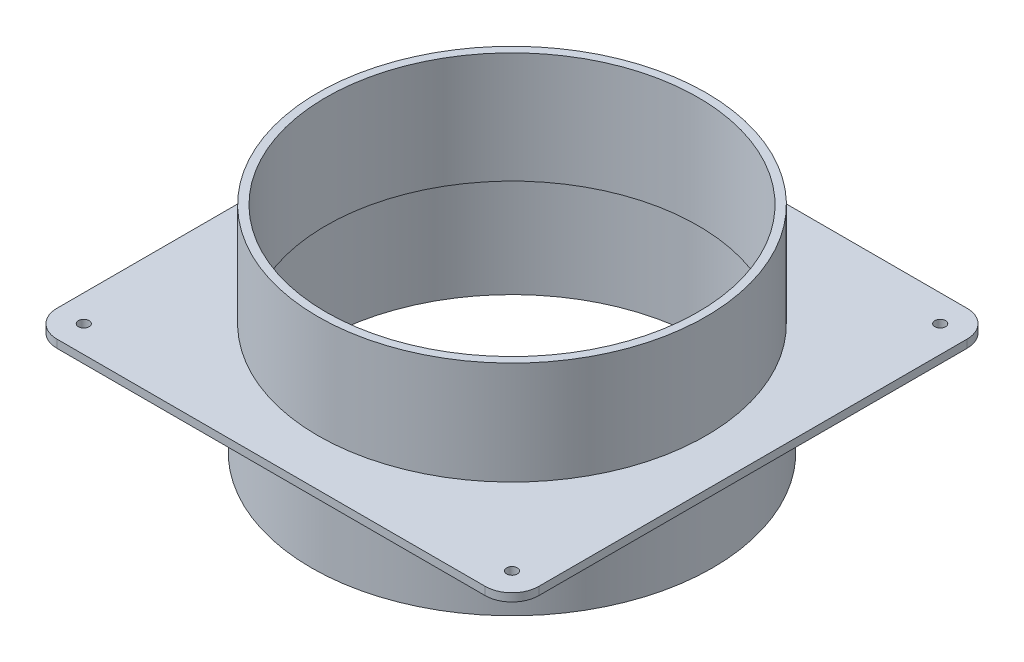
ISO-10303-21;
HEADER;
FILE_DESCRIPTION(('STEP AP214'),'2;1');
FILE_NAME('part.step','',(''),(''),'','','');
FILE_SCHEMA(('AUTOMOTIVE_DESIGN { 1 0 10303 214 1 1 1 1 }'));
ENDSEC;
DATA;
#1=APPLICATION_CONTEXT('core data for automotive mechanical design processes');
#2=APPLICATION_PROTOCOL_DEFINITION('international standard','automotive_design',2000,#1);
#3=PRODUCT_CONTEXT('',#1,'mechanical');
#4=PRODUCT('Part','Part','',(#3));
#5=PRODUCT_RELATED_PRODUCT_CATEGORY('part','',(#4));
#6=PRODUCT_DEFINITION_FORMATION('','',#4);
#7=PRODUCT_DEFINITION_CONTEXT('part definition',#1,'design');
#8=PRODUCT_DEFINITION('design','',#6,#7);
#9=PRODUCT_DEFINITION_SHAPE('','',#8);
#10=(LENGTH_UNIT() NAMED_UNIT(*) SI_UNIT(.MILLI.,.METRE.));
#11=(NAMED_UNIT(*) PLANE_ANGLE_UNIT() SI_UNIT($,.RADIAN.));
#12=(NAMED_UNIT(*) SI_UNIT($,.STERADIAN.) SOLID_ANGLE_UNIT());
#13=UNCERTAINTY_MEASURE_WITH_UNIT(LENGTH_MEASURE(1.E-05),#10,'distance_accuracy_value','');
#14=(GEOMETRIC_REPRESENTATION_CONTEXT(3) GLOBAL_UNCERTAINTY_ASSIGNED_CONTEXT((#13)) GLOBAL_UNIT_ASSIGNED_CONTEXT((#10,
#11,#12)) REPRESENTATION_CONTEXT('',''));
#15=CARTESIAN_POINT('',(0.,0.,0.));
#16=DIRECTION('',(0.,0.,1.));
#17=DIRECTION('',(1.,0.,0.));
#18=AXIS2_PLACEMENT_3D('',#15,#16,#17);
#19=CARTESIAN_POINT('',(0.,-1.50000000000006,0.));
#20=DIRECTION('',(0.,1.,0.));
#21=DIRECTION('',(0.,0.,1.));
#22=AXIS2_PLACEMENT_3D('',#19,#20,#21);
#23=PLANE('',#22);
#24=CARTESIAN_POINT('',(0.,-1.50000000000006,0.));
#25=DIRECTION('',(0.,1.,0.));
#26=DIRECTION('',(0.,0.,1.));
#27=AXIS2_PLACEMENT_3D('',#24,#25,#26);
#28=CIRCLE('',#27,69.5);
#29=CARTESIAN_POINT('',(0.,-1.50000000000006,69.5));
#30=VERTEX_POINT('',#29);
#31=EDGE_CURVE('E146',#30,#30,#28,.T.);
#32=ORIENTED_EDGE('',*,*,#31,.T.);
#33=EDGE_LOOP('',(#32));
#34=FACE_BOUND('',#33,.T.);
#35=CARTESIAN_POINT('',(0.,-1.50000000000006,0.));
#36=DIRECTION('',(0.,1.,0.));
#37=DIRECTION('',(0.,0.,1.));
#38=AXIS2_PLACEMENT_3D('',#35,#36,#37);
#39=CIRCLE('',#38,72.);
#40=CARTESIAN_POINT('',(0.,-1.50000000000006,72.));
#41=VERTEX_POINT('',#40);
#42=EDGE_CURVE('E11',#41,#41,#39,.T.);
#43=ORIENTED_EDGE('',*,*,#42,.F.);
#44=EDGE_LOOP('',(#43));
#45=FACE_BOUND('',#44,.T.);
#46=ADVANCED_FACE('F36',(#34,#45),#23,.F.);
#47=CARTESIAN_POINT('',(0.,1.50000000000006,0.));
#48=DIRECTION('',(0.,1.,0.));
#49=DIRECTION('',(0.,0.,1.));
#50=AXIS2_PLACEMENT_3D('',#47,#48,#49);
#51=PLANE('',#50);
#52=CARTESIAN_POINT('',(80.,1.50000000000006,-80.));
#53=DIRECTION('',(0.,1.,0.));
#54=DIRECTION('',(0.,0.,1.));
#55=AXIS2_PLACEMENT_3D('',#52,#53,#54);
#56=CIRCLE('',#55,9.99999999999999);
#57=CARTESIAN_POINT('',(79.9999999999999,1.50000000000006,-90.));
#58=VERTEX_POINT('',#57);
#59=CARTESIAN_POINT('',(90.,1.50000000000006,-79.9999999999999));
#60=VERTEX_POINT('',#59);
#61=EDGE_CURVE('E104',#58,#60,#56,.F.);
#62=ORIENTED_EDGE('',*,*,#61,.F.);
#63=DIRECTION('',(-1.,0.,0.));
#64=VECTOR('',#63,1.);
#65=CARTESIAN_POINT('',(0.,1.50000000000006,-90.));
#66=LINE('',#65,#64);
#67=CARTESIAN_POINT('',(-80.,1.50000000000006,-90.));
#68=VERTEX_POINT('',#67);
#69=EDGE_CURVE('E113',#58,#68,#66,.T.);
#70=ORIENTED_EDGE('',*,*,#69,.T.);
#71=CARTESIAN_POINT('',(-80.,1.50000000000006,-80.));
#72=DIRECTION('',(0.,1.,0.));
#73=DIRECTION('',(0.,0.,1.));
#74=AXIS2_PLACEMENT_3D('',#71,#72,#73);
#75=CIRCLE('',#74,9.99999999999999);
#76=CARTESIAN_POINT('',(-90.,1.50000000000006,-79.9999999999999));
#77=VERTEX_POINT('',#76);
#78=EDGE_CURVE('E118',#68,#77,#75,.T.);
#79=ORIENTED_EDGE('',*,*,#78,.T.);
#80=DIRECTION('',(0.,0.,1.));
#81=VECTOR('',#80,1.);
#82=CARTESIAN_POINT('',(-90.,1.50000000000006,0.));
#83=LINE('',#82,#81);
#84=CARTESIAN_POINT('',(-90.,1.50000000000006,79.9999999999999));
#85=VERTEX_POINT('',#84);
#86=EDGE_CURVE('E133',#77,#85,#83,.T.);
#87=ORIENTED_EDGE('',*,*,#86,.T.);
#88=CARTESIAN_POINT('',(-80.,1.50000000000006,80.));
#89=DIRECTION('',(0.,1.,0.));
#90=DIRECTION('',(0.,0.,1.));
#91=AXIS2_PLACEMENT_3D('',#88,#89,#90);
#92=CIRCLE('',#91,9.99999999999999);
#93=CARTESIAN_POINT('',(-79.9999999999999,1.50000000000006,90.));
#94=VERTEX_POINT('',#93);
#95=EDGE_CURVE('E136',#94,#85,#92,.F.);
#96=ORIENTED_EDGE('',*,*,#95,.F.);
#97=DIRECTION('',(-1.,0.,0.));
#98=VECTOR('',#97,1.);
#99=CARTESIAN_POINT('',(0.,1.50000000000006,90.));
#100=LINE('',#99,#98);
#101=CARTESIAN_POINT('',(79.9999999999999,1.50000000000006,90.));
#102=VERTEX_POINT('',#101);
#103=EDGE_CURVE('E139',#102,#94,#100,.T.);
#104=ORIENTED_EDGE('',*,*,#103,.F.);
#105=CARTESIAN_POINT('',(80.,1.50000000000006,80.));
#106=DIRECTION('',(0.,1.,0.));
#107=DIRECTION('',(0.,0.,1.));
#108=AXIS2_PLACEMENT_3D('',#105,#106,#107);
#109=CIRCLE('',#108,9.99999999999999);
#110=CARTESIAN_POINT('',(90.,1.50000000000006,79.9999999999999));
#111=VERTEX_POINT('',#110);
#112=EDGE_CURVE('E142',#111,#102,#109,.F.);
#113=ORIENTED_EDGE('',*,*,#112,.F.);
#114=DIRECTION('',(0.,0.,1.));
#115=VECTOR('',#114,1.);
#116=CARTESIAN_POINT('',(90.,1.50000000000006,0.));
#117=LINE('',#116,#115);
#118=EDGE_CURVE('E124',#60,#111,#117,.T.);
#119=ORIENTED_EDGE('',*,*,#118,.F.);
#120=EDGE_LOOP('',(#62,#70,#79,#87,#96,#104,#113,#119));
#121=FACE_BOUND('',#120,.T.);
#122=CARTESIAN_POINT('',(-80.,1.50000000000006,80.));
#123=DIRECTION('',(0.,1.,0.));
#124=DIRECTION('',(0.,0.,1.));
#125=AXIS2_PLACEMENT_3D('',#122,#123,#124);
#126=CIRCLE('',#125,2.);
#127=CARTESIAN_POINT('',(-80.,1.50000000000006,82.));
#128=VERTEX_POINT('',#127);
#129=EDGE_CURVE('E125',#128,#128,#126,.T.);
#130=ORIENTED_EDGE('',*,*,#129,.F.);
#131=EDGE_LOOP('',(#130));
#132=FACE_BOUND('',#131,.T.);
#133=CARTESIAN_POINT('',(80.,1.50000000000006,80.));
#134=DIRECTION('',(0.,1.,0.));
#135=DIRECTION('',(0.,0.,1.));
#136=AXIS2_PLACEMENT_3D('',#133,#134,#135);
#137=CIRCLE('',#136,2.);
#138=CARTESIAN_POINT('',(80.,1.50000000000006,82.));
#139=VERTEX_POINT('',#138);
#140=EDGE_CURVE('E128',#139,#139,#137,.T.);
#141=ORIENTED_EDGE('',*,*,#140,.F.);
#142=EDGE_LOOP('',(#141));
#143=FACE_BOUND('',#142,.T.);
#144=CARTESIAN_POINT('',(80.,1.50000000000006,-79.9999999999999));
#145=DIRECTION('',(0.,1.,0.));
#146=DIRECTION('',(0.,0.,1.));
#147=AXIS2_PLACEMENT_3D('',#144,#145,#146);
#148=CIRCLE('',#147,2.);
#149=CARTESIAN_POINT('',(80.,1.50000000000006,-77.9999999999999));
#150=VERTEX_POINT('',#149);
#151=EDGE_CURVE('E196',#150,#150,#148,.T.);
#152=ORIENTED_EDGE('',*,*,#151,.F.);
#153=EDGE_LOOP('',(#152));
#154=FACE_BOUND('',#153,.T.);
#155=CARTESIAN_POINT('',(-80.,1.50000000000006,-80.));
#156=DIRECTION('',(0.,1.,0.));
#157=DIRECTION('',(0.,0.,1.));
#158=AXIS2_PLACEMENT_3D('',#155,#156,#157);
#159=CIRCLE('',#158,2.);
#160=CARTESIAN_POINT('',(-80.,1.50000000000006,-78.));
#161=VERTEX_POINT('',#160);
#162=EDGE_CURVE('E191',#161,#161,#159,.T.);
#163=ORIENTED_EDGE('',*,*,#162,.F.);
#164=EDGE_LOOP('',(#163));
#165=FACE_BOUND('',#164,.T.);
#166=CARTESIAN_POINT('',(0.,1.50000000000006,0.));
#167=DIRECTION('',(0.,1.,0.));
#168=DIRECTION('',(0.,0.,1.));
#169=AXIS2_PLACEMENT_3D('',#166,#167,#168);
#170=CIRCLE('',#169,72.5);
#171=CARTESIAN_POINT('',(0.,1.50000000000006,72.5));
#172=VERTEX_POINT('',#171);
#173=EDGE_CURVE('E189',#172,#172,#170,.F.);
#174=ORIENTED_EDGE('',*,*,#173,.T.);
#175=EDGE_LOOP('',(#174));
#176=FACE_BOUND('',#175,.T.);
#177=ADVANCED_FACE('F120',(#121,#132,#143,#154,#165,#176),#51,.T.);
#178=CARTESIAN_POINT('',(80.,-1.50000000000006,-80.));
#179=DIRECTION('',(0.,1.,0.));
#180=DIRECTION('',(0.,0.,1.));
#181=AXIS2_PLACEMENT_3D('',#178,#179,#180);
#182=CYLINDRICAL_SURFACE('',#181,9.99999999999999);
#183=DIRECTION('',(0.,1.,0.));
#184=VECTOR('',#183,1.);
#185=CARTESIAN_POINT('',(79.9999999999999,-1.50000000000006,-90.));
#186=LINE('',#185,#184);
#187=CARTESIAN_POINT('',(79.9999999999999,-1.50000000000006,-90.));
#188=VERTEX_POINT('',#187);
#189=EDGE_CURVE('E99',#188,#58,#186,.T.);
#190=ORIENTED_EDGE('',*,*,#189,.T.);
#191=ORIENTED_EDGE('',*,*,#61,.T.);
#192=DIRECTION('',(0.,1.,0.));
#193=VECTOR('',#192,1.);
#194=CARTESIAN_POINT('',(90.,-1.50000000000006,-79.9999999999999));
#195=LINE('',#194,#193);
#196=CARTESIAN_POINT('',(90.,-1.50000000000006,-79.9999999999999));
#197=VERTEX_POINT('',#196);
#198=EDGE_CURVE('E45',#197,#60,#195,.T.);
#199=ORIENTED_EDGE('',*,*,#198,.F.);
#200=CARTESIAN_POINT('',(80.,-1.50000000000006,-80.));
#201=DIRECTION('',(0.,1.,0.));
#202=DIRECTION('',(0.,0.,1.));
#203=AXIS2_PLACEMENT_3D('',#200,#201,#202);
#204=CIRCLE('',#203,9.99999999999999);
#205=EDGE_CURVE('E106',#188,#197,#204,.F.);
#206=ORIENTED_EDGE('',*,*,#205,.F.);
#207=EDGE_LOOP('',(#190,#191,#199,#206));
#208=FACE_BOUND('',#207,.T.);
#209=ADVANCED_FACE('F101',(#208),#182,.T.);
#210=CARTESIAN_POINT('',(90.,-1.50000000000006,0.));
#211=DIRECTION('',(-1.,0.,0.));
#212=DIRECTION('',(0.,0.,1.));
#213=AXIS2_PLACEMENT_3D('',#210,#211,#212);
#214=PLANE('',#213);
#215=ORIENTED_EDGE('',*,*,#198,.T.);
#216=ORIENTED_EDGE('',*,*,#118,.T.);
#217=DIRECTION('',(0.,1.,0.));
#218=VECTOR('',#217,1.);
#219=CARTESIAN_POINT('',(90.,-1.50000000000006,79.9999999999999));
#220=LINE('',#219,#218);
#221=CARTESIAN_POINT('',(90.,-1.50000000000006,79.9999999999999));
#222=VERTEX_POINT('',#221);
#223=EDGE_CURVE('E178',#222,#111,#220,.T.);
#224=ORIENTED_EDGE('',*,*,#223,.F.);
#225=DIRECTION('',(0.,0.,1.));
#226=VECTOR('',#225,1.);
#227=CARTESIAN_POINT('',(90.,-1.50000000000006,0.));
#228=LINE('',#227,#226);
#229=EDGE_CURVE('E52',#197,#222,#228,.T.);
#230=ORIENTED_EDGE('',*,*,#229,.F.);
#231=EDGE_LOOP('',(#215,#216,#224,#230));
#232=FACE_BOUND('',#231,.T.);
#233=ADVANCED_FACE('F260',(#232),#214,.F.);
#234=CARTESIAN_POINT('',(80.,-1.50000000000006,80.));
#235=DIRECTION('',(0.,1.,0.));
#236=DIRECTION('',(0.,0.,1.));
#237=AXIS2_PLACEMENT_3D('',#234,#235,#236);
#238=CYLINDRICAL_SURFACE('',#237,9.99999999999999);
#239=ORIENTED_EDGE('',*,*,#223,.T.);
#240=ORIENTED_EDGE('',*,*,#112,.T.);
#241=DIRECTION('',(0.,1.,0.));
#242=VECTOR('',#241,1.);
#243=CARTESIAN_POINT('',(79.9999999999999,-1.50000000000006,90.));
#244=LINE('',#243,#242);
#245=CARTESIAN_POINT('',(79.9999999999999,-1.50000000000006,90.));
#246=VERTEX_POINT('',#245);
#247=EDGE_CURVE('E180',#246,#102,#244,.T.);
#248=ORIENTED_EDGE('',*,*,#247,.F.);
#249=CARTESIAN_POINT('',(80.,-1.50000000000006,80.));
#250=DIRECTION('',(0.,1.,0.));
#251=DIRECTION('',(0.,0.,1.));
#252=AXIS2_PLACEMENT_3D('',#249,#250,#251);
#253=CIRCLE('',#252,9.99999999999999);
#254=EDGE_CURVE('E174',#222,#246,#253,.F.);
#255=ORIENTED_EDGE('',*,*,#254,.F.);
#256=EDGE_LOOP('',(#239,#240,#248,#255));
#257=FACE_BOUND('',#256,.T.);
#258=ADVANCED_FACE('F264',(#257),#238,.T.);
#259=CARTESIAN_POINT('',(0.,-1.50000000000006,90.));
#260=DIRECTION('',(0.,0.,-1.));
#261=DIRECTION('',(-1.,0.,0.));
#262=AXIS2_PLACEMENT_3D('',#259,#260,#261);
#263=PLANE('',#262);
#264=ORIENTED_EDGE('',*,*,#247,.T.);
#265=ORIENTED_EDGE('',*,*,#103,.T.);
#266=DIRECTION('',(0.,1.,0.));
#267=VECTOR('',#266,1.);
#268=CARTESIAN_POINT('',(-79.9999999999999,-1.50000000000006,90.));
#269=LINE('',#268,#267);
#270=CARTESIAN_POINT('',(-79.9999999999999,-1.50000000000006,90.));
#271=VERTEX_POINT('',#270);
#272=EDGE_CURVE('E182',#271,#94,#269,.T.);
#273=ORIENTED_EDGE('',*,*,#272,.F.);
#274=DIRECTION('',(-1.,0.,0.));
#275=VECTOR('',#274,1.);
#276=CARTESIAN_POINT('',(0.,-1.50000000000006,90.));
#277=LINE('',#276,#275);
#278=EDGE_CURVE('E172',#246,#271,#277,.T.);
#279=ORIENTED_EDGE('',*,*,#278,.F.);
#280=EDGE_LOOP('',(#264,#265,#273,#279));
#281=FACE_BOUND('',#280,.T.);
#282=ADVANCED_FACE('F271',(#281),#263,.F.);
#283=CARTESIAN_POINT('',(-80.,-1.50000000000006,80.));
#284=DIRECTION('',(0.,1.,0.));
#285=DIRECTION('',(0.,0.,1.));
#286=AXIS2_PLACEMENT_3D('',#283,#284,#285);
#287=CYLINDRICAL_SURFACE('',#286,9.99999999999999);
#288=ORIENTED_EDGE('',*,*,#272,.T.);
#289=ORIENTED_EDGE('',*,*,#95,.T.);
#290=DIRECTION('',(0.,1.,0.));
#291=VECTOR('',#290,1.);
#292=CARTESIAN_POINT('',(-90.,-1.50000000000006,79.9999999999999));
#293=LINE('',#292,#291);
#294=CARTESIAN_POINT('',(-90.,-1.50000000000006,79.9999999999999));
#295=VERTEX_POINT('',#294);
#296=EDGE_CURVE('E184',#295,#85,#293,.T.);
#297=ORIENTED_EDGE('',*,*,#296,.F.);
#298=CARTESIAN_POINT('',(-80.,-1.50000000000006,80.));
#299=DIRECTION('',(0.,1.,0.));
#300=DIRECTION('',(0.,0.,1.));
#301=AXIS2_PLACEMENT_3D('',#298,#299,#300);
#302=CIRCLE('',#301,9.99999999999999);
#303=EDGE_CURVE('E170',#271,#295,#302,.F.);
#304=ORIENTED_EDGE('',*,*,#303,.F.);
#305=EDGE_LOOP('',(#288,#289,#297,#304));
#306=FACE_BOUND('',#305,.T.);
#307=ADVANCED_FACE('F275',(#306),#287,.T.);
#308=CARTESIAN_POINT('',(-90.,-1.50000000000006,0.));
#309=DIRECTION('',(-1.,0.,0.));
#310=DIRECTION('',(0.,0.,1.));
#311=AXIS2_PLACEMENT_3D('',#308,#309,#310);
#312=PLANE('',#311);
#313=ORIENTED_EDGE('',*,*,#296,.T.);
#314=ORIENTED_EDGE('',*,*,#86,.F.);
#315=DIRECTION('',(0.,1.,0.));
#316=VECTOR('',#315,1.);
#317=CARTESIAN_POINT('',(-90.,-1.50000000000006,-79.9999999999999));
#318=LINE('',#317,#316);
#319=CARTESIAN_POINT('',(-90.,-1.50000000000006,-79.9999999999999));
#320=VERTEX_POINT('',#319);
#321=EDGE_CURVE('E186',#320,#77,#318,.T.);
#322=ORIENTED_EDGE('',*,*,#321,.F.);
#323=DIRECTION('',(0.,0.,1.));
#324=VECTOR('',#323,1.);
#325=CARTESIAN_POINT('',(-90.,-1.50000000000006,0.));
#326=LINE('',#325,#324);
#327=EDGE_CURVE('E167',#320,#295,#326,.T.);
#328=ORIENTED_EDGE('',*,*,#327,.T.);
#329=EDGE_LOOP('',(#313,#314,#322,#328));
#330=FACE_BOUND('',#329,.T.);
#331=ADVANCED_FACE('F278',(#330),#312,.T.);
#332=CARTESIAN_POINT('',(-80.,-1.50000000000006,-80.));
#333=DIRECTION('',(0.,1.,0.));
#334=DIRECTION('',(0.,0.,1.));
#335=AXIS2_PLACEMENT_3D('',#332,#333,#334);
#336=CYLINDRICAL_SURFACE('',#335,9.99999999999999);
#337=ORIENTED_EDGE('',*,*,#321,.T.);
#338=ORIENTED_EDGE('',*,*,#78,.F.);
#339=DIRECTION('',(0.,1.,0.));
#340=VECTOR('',#339,1.);
#341=CARTESIAN_POINT('',(-80.,-1.50000000000006,-90.));
#342=LINE('',#341,#340);
#343=CARTESIAN_POINT('',(-80.,-1.50000000000006,-90.));
#344=VERTEX_POINT('',#343);
#345=EDGE_CURVE('E110',#344,#68,#342,.T.);
#346=ORIENTED_EDGE('',*,*,#345,.F.);
#347=CARTESIAN_POINT('',(-80.,-1.50000000000006,-80.));
#348=DIRECTION('',(0.,1.,0.));
#349=DIRECTION('',(0.,0.,1.));
#350=AXIS2_PLACEMENT_3D('',#347,#348,#349);
#351=CIRCLE('',#350,9.99999999999999);
#352=EDGE_CURVE('E164',#344,#320,#351,.T.);
#353=ORIENTED_EDGE('',*,*,#352,.T.);
#354=EDGE_LOOP('',(#337,#338,#346,#353));
#355=FACE_BOUND('',#354,.T.);
#356=ADVANCED_FACE('F280',(#355),#336,.T.);
#357=CARTESIAN_POINT('',(-80.,-1.50000000000006,80.));
#358=DIRECTION('',(0.,1.,0.));
#359=DIRECTION('',(0.,0.,1.));
#360=AXIS2_PLACEMENT_3D('',#357,#358,#359);
#361=CYLINDRICAL_SURFACE('',#360,2.);
#362=CARTESIAN_POINT('',(-80.,-1.50000000000006,80.));
#363=DIRECTION('',(0.,1.,0.));
#364=DIRECTION('',(0.,0.,1.));
#365=AXIS2_PLACEMENT_3D('',#362,#363,#364);
#366=CIRCLE('',#365,2.);
#367=CARTESIAN_POINT('',(-80.,-1.50000000000006,82.));
#368=VERTEX_POINT('',#367);
#369=EDGE_CURVE('E158',#368,#368,#366,.T.);
#370=ORIENTED_EDGE('',*,*,#369,.F.);
#371=EDGE_LOOP('',(#370));
#372=FACE_BOUND('',#371,.T.);
#373=ORIENTED_EDGE('',*,*,#129,.T.);
#374=EDGE_LOOP('',(#373));
#375=FACE_BOUND('',#374,.T.);
#376=ADVANCED_FACE('F282',(#372,#375),#361,.F.);
#377=CARTESIAN_POINT('',(80.,-1.50000000000006,80.));
#378=DIRECTION('',(0.,1.,0.));
#379=DIRECTION('',(0.,0.,1.));
#380=AXIS2_PLACEMENT_3D('',#377,#378,#379);
#381=CYLINDRICAL_SURFACE('',#380,2.);
#382=CARTESIAN_POINT('',(80.,-1.50000000000006,80.));
#383=DIRECTION('',(0.,1.,0.));
#384=DIRECTION('',(0.,0.,1.));
#385=AXIS2_PLACEMENT_3D('',#382,#383,#384);
#386=CIRCLE('',#385,2.);
#387=CARTESIAN_POINT('',(80.,-1.50000000000006,82.));
#388=VERTEX_POINT('',#387);
#389=EDGE_CURVE('E155',#388,#388,#386,.T.);
#390=ORIENTED_EDGE('',*,*,#389,.F.);
#391=EDGE_LOOP('',(#390));
#392=FACE_BOUND('',#391,.T.);
#393=ORIENTED_EDGE('',*,*,#140,.T.);
#394=EDGE_LOOP('',(#393));
#395=FACE_BOUND('',#394,.T.);
#396=ADVANCED_FACE('F211',(#392,#395),#381,.F.);
#397=CARTESIAN_POINT('',(80.,-1.50000000000006,-79.9999999999999));
#398=DIRECTION('',(0.,1.,0.));
#399=DIRECTION('',(0.,0.,1.));
#400=AXIS2_PLACEMENT_3D('',#397,#398,#399);
#401=CYLINDRICAL_SURFACE('',#400,2.);
#402=CARTESIAN_POINT('',(80.,-1.50000000000006,-79.9999999999999));
#403=DIRECTION('',(0.,1.,0.));
#404=DIRECTION('',(0.,0.,1.));
#405=AXIS2_PLACEMENT_3D('',#402,#403,#404);
#406=CIRCLE('',#405,2.);
#407=CARTESIAN_POINT('',(80.,-1.50000000000006,-77.9999999999999));
#408=VERTEX_POINT('',#407);
#409=EDGE_CURVE('E152',#408,#408,#406,.T.);
#410=ORIENTED_EDGE('',*,*,#409,.F.);
#411=EDGE_LOOP('',(#410));
#412=FACE_BOUND('',#411,.T.);
#413=ORIENTED_EDGE('',*,*,#151,.T.);
#414=EDGE_LOOP('',(#413));
#415=FACE_BOUND('',#414,.T.);
#416=ADVANCED_FACE('F222',(#412,#415),#401,.F.);
#417=CARTESIAN_POINT('',(-80.,-1.50000000000006,-80.));
#418=DIRECTION('',(0.,1.,0.));
#419=DIRECTION('',(0.,0.,1.));
#420=AXIS2_PLACEMENT_3D('',#417,#418,#419);
#421=CYLINDRICAL_SURFACE('',#420,2.);
#422=CARTESIAN_POINT('',(-80.,-1.50000000000006,-80.));
#423=DIRECTION('',(0.,1.,0.));
#424=DIRECTION('',(0.,0.,1.));
#425=AXIS2_PLACEMENT_3D('',#422,#423,#424);
#426=CIRCLE('',#425,2.);
#427=CARTESIAN_POINT('',(-80.,-1.50000000000006,-78.));
#428=VERTEX_POINT('',#427);
#429=EDGE_CURVE('E149',#428,#428,#426,.T.);
#430=ORIENTED_EDGE('',*,*,#429,.F.);
#431=EDGE_LOOP('',(#430));
#432=FACE_BOUND('',#431,.T.);
#433=ORIENTED_EDGE('',*,*,#162,.T.);
#434=EDGE_LOOP('',(#433));
#435=FACE_BOUND('',#434,.T.);
#436=ADVANCED_FACE('F220',(#432,#435),#421,.F.);
#437=CARTESIAN_POINT('',(0.,-1.50000000000006,0.));
#438=DIRECTION('',(0.,1.,0.));
#439=DIRECTION('',(0.,0.,1.));
#440=AXIS2_PLACEMENT_3D('',#437,#438,#439);
#441=CYLINDRICAL_SURFACE('',#440,69.5);
#442=CARTESIAN_POINT('',(0.,40.,0.));
#443=DIRECTION('',(0.,1.,0.));
#444=DIRECTION('',(0.,0.,1.));
#445=AXIS2_PLACEMENT_3D('',#442,#443,#444);
#446=CIRCLE('',#445,69.5);
#447=CARTESIAN_POINT('',(0.,40.,69.5));
#448=VERTEX_POINT('',#447);
#449=EDGE_CURVE('E199',#448,#448,#446,.T.);
#450=ORIENTED_EDGE('',*,*,#449,.T.);
#451=EDGE_LOOP('',(#450));
#452=FACE_BOUND('',#451,.T.);
#453=ORIENTED_EDGE('',*,*,#31,.F.);
#454=EDGE_LOOP('',(#453));
#455=FACE_BOUND('',#454,.T.);
#456=ADVANCED_FACE('F38',(#452,#455),#441,.F.);
#457=CARTESIAN_POINT('',(0.,-1.50000000000006,-90.));
#458=DIRECTION('',(0.,0.,-1.));
#459=DIRECTION('',(-1.,0.,0.));
#460=AXIS2_PLACEMENT_3D('',#457,#458,#459);
#461=PLANE('',#460);
#462=ORIENTED_EDGE('',*,*,#345,.T.);
#463=ORIENTED_EDGE('',*,*,#69,.F.);
#464=ORIENTED_EDGE('',*,*,#189,.F.);
#465=DIRECTION('',(-1.,0.,0.));
#466=VECTOR('',#465,1.);
#467=CARTESIAN_POINT('',(0.,-1.50000000000006,-90.));
#468=LINE('',#467,#466);
#469=EDGE_CURVE('E162',#188,#344,#468,.T.);
#470=ORIENTED_EDGE('',*,*,#469,.T.);
#471=EDGE_LOOP('',(#462,#463,#464,#470));
#472=FACE_BOUND('',#471,.T.);
#473=ADVANCED_FACE('F114',(#472),#461,.T.);
#474=CARTESIAN_POINT('',(0.,-1.50000000000006,0.));
#475=DIRECTION('',(0.,1.,0.));
#476=DIRECTION('',(0.,0.,1.));
#477=AXIS2_PLACEMENT_3D('',#474,#475,#476);
#478=CIRCLE('',#477,75.);
#479=CARTESIAN_POINT('',(0.,-1.50000000000006,75.));
#480=VERTEX_POINT('',#479);
#481=EDGE_CURVE('E40',#480,#480,#478,.T.);
#482=ORIENTED_EDGE('',*,*,#481,.T.);
#483=EDGE_LOOP('',(#482));
#484=FACE_BOUND('',#483,.T.);
#485=ORIENTED_EDGE('',*,*,#429,.T.);
#486=EDGE_LOOP('',(#485));
#487=FACE_BOUND('',#486,.T.);
#488=ORIENTED_EDGE('',*,*,#409,.T.);
#489=EDGE_LOOP('',(#488));
#490=FACE_BOUND('',#489,.T.);
#491=ORIENTED_EDGE('',*,*,#389,.T.);
#492=EDGE_LOOP('',(#491));
#493=FACE_BOUND('',#492,.T.);
#494=ORIENTED_EDGE('',*,*,#369,.T.);
#495=EDGE_LOOP('',(#494));
#496=FACE_BOUND('',#495,.T.);
#497=ORIENTED_EDGE('',*,*,#205,.T.);
#498=ORIENTED_EDGE('',*,*,#229,.T.);
#499=ORIENTED_EDGE('',*,*,#254,.T.);
#500=ORIENTED_EDGE('',*,*,#278,.T.);
#501=ORIENTED_EDGE('',*,*,#303,.T.);
#502=ORIENTED_EDGE('',*,*,#327,.F.);
#503=ORIENTED_EDGE('',*,*,#352,.F.);
#504=ORIENTED_EDGE('',*,*,#469,.F.);
#505=EDGE_LOOP('',(#497,#498,#499,#500,#501,#502,#503,#504));
#506=FACE_BOUND('',#505,.T.);
#507=ADVANCED_FACE('F235',(#484,#487,#490,#493,#496,#506),#23,.F.);
#508=CARTESIAN_POINT('',(0.,40.,0.));
#509=DIRECTION('',(0.,1.,0.));
#510=DIRECTION('',(0.,0.,1.));
#511=AXIS2_PLACEMENT_3D('',#508,#509,#510);
#512=PLANE('',#511);
#513=CARTESIAN_POINT('',(0.,40.,0.));
#514=DIRECTION('',(0.,1.,0.));
#515=DIRECTION('',(0.,0.,1.));
#516=AXIS2_PLACEMENT_3D('',#513,#514,#515);
#517=CIRCLE('',#516,72.5);
#518=CARTESIAN_POINT('',(0.,40.,72.5));
#519=VERTEX_POINT('',#518);
#520=EDGE_CURVE('E192',#519,#519,#517,.T.);
#521=ORIENTED_EDGE('',*,*,#520,.T.);
#522=EDGE_LOOP('',(#521));
#523=FACE_BOUND('',#522,.T.);
#524=ORIENTED_EDGE('',*,*,#449,.F.);
#525=EDGE_LOOP('',(#524));
#526=FACE_BOUND('',#525,.T.);
#527=ADVANCED_FACE('F241',(#523,#526),#512,.T.);
#528=CARTESIAN_POINT('',(0.,40.,0.));
#529=DIRECTION('',(0.,-1.,0.));
#530=DIRECTION('',(0.,0.,-1.));
#531=AXIS2_PLACEMENT_3D('',#528,#529,#530);
#532=CYLINDRICAL_SURFACE('',#531,72.5);
#533=ORIENTED_EDGE('',*,*,#173,.F.);
#534=EDGE_LOOP('',(#533));
#535=FACE_BOUND('',#534,.T.);
#536=ORIENTED_EDGE('',*,*,#520,.F.);
#537=EDGE_LOOP('',(#536));
#538=FACE_BOUND('',#537,.T.);
#539=ADVANCED_FACE('F247',(#535,#538),#532,.T.);
#540=CARTESIAN_POINT('',(0.,-40.,0.));
#541=DIRECTION('',(0.,1.,0.));
#542=DIRECTION('',(0.,0.,1.));
#543=AXIS2_PLACEMENT_3D('',#540,#541,#542);
#544=CYLINDRICAL_SURFACE('',#543,75.);
#545=CARTESIAN_POINT('',(0.,-40.,0.));
#546=DIRECTION('',(0.,1.,0.));
#547=DIRECTION('',(0.,0.,1.));
#548=AXIS2_PLACEMENT_3D('',#545,#546,#547);
#549=CIRCLE('',#548,75.);
#550=CARTESIAN_POINT('',(0.,-40.,75.));
#551=VERTEX_POINT('',#550);
#552=EDGE_CURVE('E383',#551,#551,#549,.T.);
#553=ORIENTED_EDGE('',*,*,#552,.T.);
#554=EDGE_LOOP('',(#553));
#555=FACE_BOUND('',#554,.T.);
#556=ORIENTED_EDGE('',*,*,#481,.F.);
#557=EDGE_LOOP('',(#556));
#558=FACE_BOUND('',#557,.T.);
#559=ADVANCED_FACE('F342',(#555,#558),#544,.T.);
#560=CARTESIAN_POINT('',(0.,-40.,0.));
#561=DIRECTION('',(0.,1.,0.));
#562=DIRECTION('',(0.,0.,1.));
#563=AXIS2_PLACEMENT_3D('',#560,#561,#562);
#564=CYLINDRICAL_SURFACE('',#563,72.);
#565=CARTESIAN_POINT('',(0.,-40.,0.));
#566=DIRECTION('',(0.,1.,0.));
#567=DIRECTION('',(0.,0.,1.));
#568=AXIS2_PLACEMENT_3D('',#565,#566,#567);
#569=CIRCLE('',#568,72.);
#570=CARTESIAN_POINT('',(0.,-40.,72.));
#571=VERTEX_POINT('',#570);
#572=EDGE_CURVE('E380',#571,#571,#569,.T.);
#573=ORIENTED_EDGE('',*,*,#572,.F.);
#574=EDGE_LOOP('',(#573));
#575=FACE_BOUND('',#574,.T.);
#576=ORIENTED_EDGE('',*,*,#42,.T.);
#577=EDGE_LOOP('',(#576));
#578=FACE_BOUND('',#577,.T.);
#579=ADVANCED_FACE('F353',(#575,#578),#564,.F.);
#580=CARTESIAN_POINT('',(0.,-40.,0.));
#581=DIRECTION('',(0.,1.,0.));
#582=DIRECTION('',(0.,0.,1.));
#583=AXIS2_PLACEMENT_3D('',#580,#581,#582);
#584=PLANE('',#583);
#585=ORIENTED_EDGE('',*,*,#572,.T.);
#586=EDGE_LOOP('',(#585));
#587=FACE_BOUND('',#586,.T.);
#588=ORIENTED_EDGE('',*,*,#552,.F.);
#589=EDGE_LOOP('',(#588));
#590=FACE_BOUND('',#589,.T.);
#591=ADVANCED_FACE('F363',(#587,#590),#584,.F.);
#592=CLOSED_SHELL('',(#46,#177,#209,#233,#258,#282,#307,#331,#356,#376,#396,#416,#436,#456,#473,
#507,#527,#539,#559,#579,#591));
#593=MANIFOLD_SOLID_BREP('B2',#592);
#594=ADVANCED_BREP_SHAPE_REPRESENTATION('',(#18,#593),#14);
#595=SHAPE_DEFINITION_REPRESENTATION(#9,#594);
ENDSEC;
END-ISO-10303-21;
